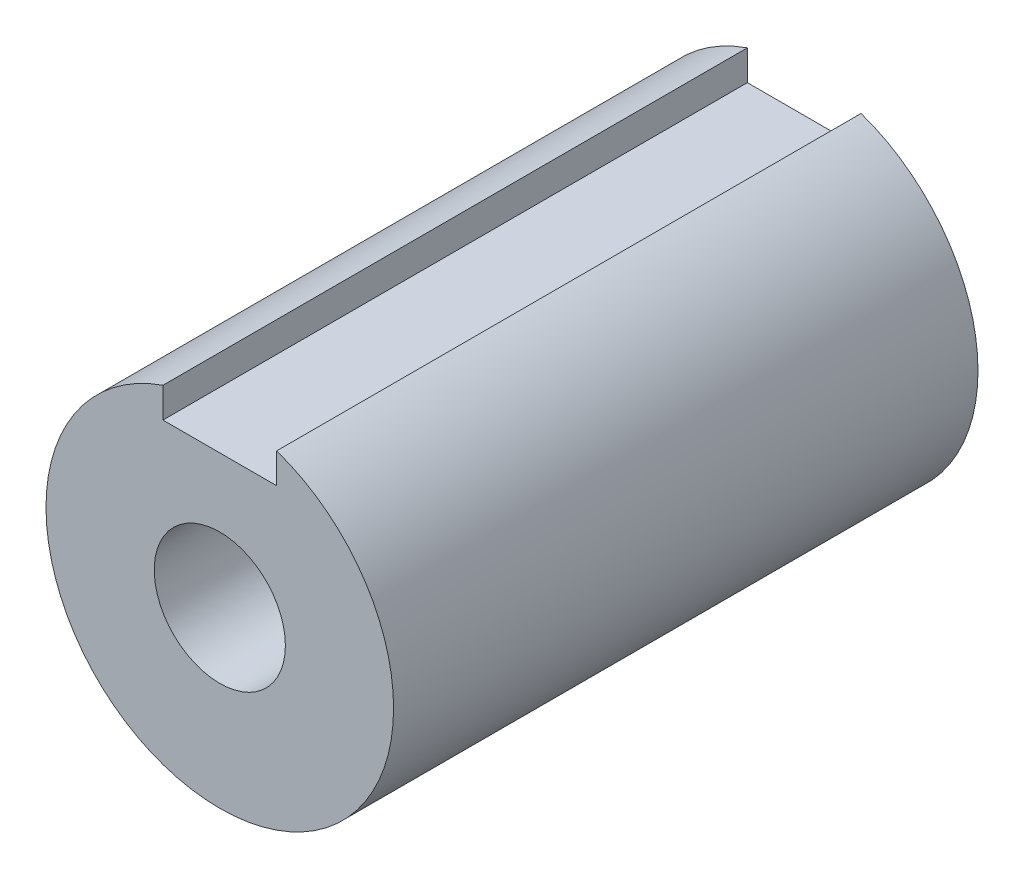
ISO-10303-21;
HEADER;
FILE_DESCRIPTION(('STEP AP214'),'2;1');
FILE_NAME('part.step','',(''),(''),'','','');
FILE_SCHEMA(('AUTOMOTIVE_DESIGN { 1 0 10303 214 1 1 1 1 }'));
ENDSEC;
DATA;
#1=APPLICATION_CONTEXT('core data for automotive mechanical design processes');
#2=APPLICATION_PROTOCOL_DEFINITION('international standard','automotive_design',2000,#1);
#3=PRODUCT_CONTEXT('',#1,'mechanical');
#4=PRODUCT('Part','Part','',(#3));
#5=PRODUCT_RELATED_PRODUCT_CATEGORY('part','',(#4));
#6=PRODUCT_DEFINITION_FORMATION('','',#4);
#7=PRODUCT_DEFINITION_CONTEXT('part definition',#1,'design');
#8=PRODUCT_DEFINITION('design','',#6,#7);
#9=PRODUCT_DEFINITION_SHAPE('','',#8);
#10=(LENGTH_UNIT() NAMED_UNIT(*) SI_UNIT(.MILLI.,.METRE.));
#11=(NAMED_UNIT(*) PLANE_ANGLE_UNIT() SI_UNIT($,.RADIAN.));
#12=(NAMED_UNIT(*) SI_UNIT($,.STERADIAN.) SOLID_ANGLE_UNIT());
#13=UNCERTAINTY_MEASURE_WITH_UNIT(LENGTH_MEASURE(1.E-05),#10,'distance_accuracy_value','');
#14=(GEOMETRIC_REPRESENTATION_CONTEXT(3) GLOBAL_UNCERTAINTY_ASSIGNED_CONTEXT((#13)) GLOBAL_UNIT_ASSIGNED_CONTEXT((#10,
#11,#12)) REPRESENTATION_CONTEXT('',''));
#15=CARTESIAN_POINT('',(0.,0.,0.));
#16=DIRECTION('',(0.,0.,1.));
#17=DIRECTION('',(1.,0.,0.));
#18=AXIS2_PLACEMENT_3D('',#15,#16,#17);
#19=CARTESIAN_POINT('',(0.,0.,9.77));
#20=DIRECTION('',(0.,0.,1.));
#21=DIRECTION('',(1.,0.,0.));
#22=AXIS2_PLACEMENT_3D('',#19,#20,#21);
#23=PLANE('',#22);
#24=DIRECTION('',(0.99996932426467,-0.00783265789241257,0.));
#25=VECTOR('',#24,1.);
#26=CARTESIAN_POINT('',(6.49805597382803,5.47953178300827,9.77));
#27=LINE('',#26,#25);
#28=CARTESIAN_POINT('',(-6.41142269290476,5.58065041486258,9.77));
#29=VERTEX_POINT('',#28);
#30=CARTESIAN_POINT('',(6.49805597382803,5.47953178300827,9.77));
#31=VERTEX_POINT('',#30);
#32=EDGE_CURVE('E128',#29,#31,#27,.T.);
#33=ORIENTED_EDGE('',*,*,#32,.F.);
#34=CARTESIAN_POINT('',(0.,0.,9.77));
#35=DIRECTION('',(0.,0.,1.));
#36=DIRECTION('',(1.,0.,0.));
#37=AXIS2_PLACEMENT_3D('',#34,#35,#36);
#38=CIRCLE('',#37,8.5);
#39=EDGE_CURVE('E136',#31,#29,#38,.T.);
#40=ORIENTED_EDGE('',*,*,#39,.F.);
#41=EDGE_LOOP('',(#33,#40));
#42=FACE_BOUND('',#41,.T.);
#43=ADVANCED_FACE('F33',(#42),#23,.F.);
#44=CARTESIAN_POINT('',(0.,0.,40.1));
#45=DIRECTION('',(0.,0.,-1.));
#46=DIRECTION('',(-1.,0.,0.));
#47=AXIS2_PLACEMENT_3D('',#44,#45,#46);
#48=CYLINDRICAL_SURFACE('',#47,11.925);
#49=CARTESIAN_POINT('',(0.,0.,40.1));
#50=DIRECTION('',(0.,0.,1.));
#51=DIRECTION('',(1.,0.,0.));
#52=AXIS2_PLACEMENT_3D('',#49,#50,#51);
#53=CIRCLE('',#52,11.925);
#54=CARTESIAN_POINT('',(-3.9,11.2692335586765,40.1));
#55=VERTEX_POINT('',#54);
#56=CARTESIAN_POINT('',(3.9,11.2692335586765,40.1));
#57=VERTEX_POINT('',#56);
#58=EDGE_CURVE('E11',#55,#57,#53,.T.);
#59=ORIENTED_EDGE('',*,*,#58,.F.);
#60=DIRECTION('',(0.,0.,1.));
#61=VECTOR('',#60,1.);
#62=CARTESIAN_POINT('',(-3.9,11.2692335586765,0.));
#63=LINE('',#62,#61);
#64=CARTESIAN_POINT('',(-3.9,11.2692335586765,0.));
#65=VERTEX_POINT('',#64);
#66=EDGE_CURVE('E119',#65,#55,#63,.T.);
#67=ORIENTED_EDGE('',*,*,#66,.F.);
#68=CARTESIAN_POINT('',(0.,0.,0.));
#69=DIRECTION('',(0.,0.,1.));
#70=DIRECTION('',(1.,0.,0.));
#71=AXIS2_PLACEMENT_3D('',#68,#69,#70);
#72=CIRCLE('',#71,11.925);
#73=CARTESIAN_POINT('',(3.9,11.2692335586765,0.));
#74=VERTEX_POINT('',#73);
#75=EDGE_CURVE('E42',#65,#74,#72,.T.);
#76=ORIENTED_EDGE('',*,*,#75,.T.);
#77=DIRECTION('',(0.,0.,1.));
#78=VECTOR('',#77,1.);
#79=CARTESIAN_POINT('',(3.9,11.2692335586765,0.));
#80=LINE('',#79,#78);
#81=EDGE_CURVE('E50',#74,#57,#80,.T.);
#82=ORIENTED_EDGE('',*,*,#81,.T.);
#83=EDGE_LOOP('',(#59,#67,#76,#82));
#84=FACE_BOUND('',#83,.T.);
#85=ADVANCED_FACE('F35',(#84),#48,.T.);
#86=CARTESIAN_POINT('',(0.,0.,40.1));
#87=DIRECTION('',(0.,0.,1.));
#88=DIRECTION('',(1.,0.,0.));
#89=AXIS2_PLACEMENT_3D('',#86,#87,#88);
#90=PLANE('',#89);
#91=DIRECTION('',(0.,-1.,0.));
#92=VECTOR('',#91,1.);
#93=CARTESIAN_POINT('',(-3.9,11.2692335586765,40.1));
#94=LINE('',#93,#92);
#95=CARTESIAN_POINT('',(-3.9,9.19959916758711,40.1));
#96=VERTEX_POINT('',#95);
#97=EDGE_CURVE('E107',#55,#96,#94,.T.);
#98=ORIENTED_EDGE('',*,*,#97,.F.);
#99=ORIENTED_EDGE('',*,*,#58,.T.);
#100=DIRECTION('',(0.,1.,0.));
#101=VECTOR('',#100,1.);
#102=CARTESIAN_POINT('',(3.9,9.19959916758711,40.1));
#103=LINE('',#102,#101);
#104=CARTESIAN_POINT('',(3.9,9.19959916758711,40.1));
#105=VERTEX_POINT('',#104);
#106=EDGE_CURVE('E110',#105,#57,#103,.T.);
#107=ORIENTED_EDGE('',*,*,#106,.F.);
#108=DIRECTION('',(1.,0.,0.));
#109=VECTOR('',#108,1.);
#110=CARTESIAN_POINT('',(-3.9,9.19959916758711,40.1));
#111=LINE('',#110,#109);
#112=EDGE_CURVE('E96',#96,#105,#111,.T.);
#113=ORIENTED_EDGE('',*,*,#112,.F.);
#114=EDGE_LOOP('',(#98,#99,#107,#113));
#115=FACE_BOUND('',#114,.T.);
#116=CARTESIAN_POINT('',(0.,0.,40.1));
#117=DIRECTION('',(0.,0.,1.));
#118=DIRECTION('',(1.,0.,0.));
#119=AXIS2_PLACEMENT_3D('',#116,#117,#118);
#120=CIRCLE('',#119,4.5);
#121=CARTESIAN_POINT('',(4.5,0.,40.1));
#122=VERTEX_POINT('',#121);
#123=EDGE_CURVE('E118',#122,#122,#120,.T.);
#124=ORIENTED_EDGE('',*,*,#123,.F.);
#125=EDGE_LOOP('',(#124));
#126=FACE_BOUND('',#125,.T.);
#127=ADVANCED_FACE('F147',(#115,#126),#90,.T.);
#128=CARTESIAN_POINT('',(0.,0.,0.));
#129=DIRECTION('',(0.,0.,1.));
#130=DIRECTION('',(1.,0.,0.));
#131=AXIS2_PLACEMENT_3D('',#128,#129,#130);
#132=PLANE('',#131);
#133=CARTESIAN_POINT('',(0.,0.,0.));
#134=DIRECTION('',(0.,0.,1.));
#135=DIRECTION('',(1.,0.,0.));
#136=AXIS2_PLACEMENT_3D('',#133,#134,#135);
#137=CIRCLE('',#136,8.5);
#138=CARTESIAN_POINT('',(8.5,0.,0.));
#139=VERTEX_POINT('',#138);
#140=EDGE_CURVE('E134',#139,#139,#137,.T.);
#141=ORIENTED_EDGE('',*,*,#140,.T.);
#142=EDGE_LOOP('',(#141));
#143=FACE_BOUND('',#142,.T.);
#144=ORIENTED_EDGE('',*,*,#75,.F.);
#145=DIRECTION('',(0.,-1.,0.));
#146=VECTOR('',#145,1.);
#147=CARTESIAN_POINT('',(-3.9,11.2692335586765,0.));
#148=LINE('',#147,#146);
#149=CARTESIAN_POINT('',(-3.9,9.19959916758711,0.));
#150=VERTEX_POINT('',#149);
#151=EDGE_CURVE('E98',#65,#150,#148,.T.);
#152=ORIENTED_EDGE('',*,*,#151,.T.);
#153=DIRECTION('',(1.,0.,0.));
#154=VECTOR('',#153,1.);
#155=CARTESIAN_POINT('',(-3.9,9.19959916758711,0.));
#156=LINE('',#155,#154);
#157=CARTESIAN_POINT('',(3.9,9.19959916758711,0.));
#158=VERTEX_POINT('',#157);
#159=EDGE_CURVE('E93',#150,#158,#156,.T.);
#160=ORIENTED_EDGE('',*,*,#159,.T.);
#161=DIRECTION('',(0.,1.,0.));
#162=VECTOR('',#161,1.);
#163=CARTESIAN_POINT('',(3.9,9.19959916758711,0.));
#164=LINE('',#163,#162);
#165=EDGE_CURVE('E100',#158,#74,#164,.T.);
#166=ORIENTED_EDGE('',*,*,#165,.T.);
#167=EDGE_LOOP('',(#144,#152,#160,#166));
#168=FACE_BOUND('',#167,.T.);
#169=ADVANCED_FACE('F106',(#143,#168),#132,.F.);
#170=CARTESIAN_POINT('',(0.,0.,9.77));
#171=DIRECTION('',(0.,0.,-1.));
#172=DIRECTION('',(-1.,0.,0.));
#173=AXIS2_PLACEMENT_3D('',#170,#171,#172);
#174=CYLINDRICAL_SURFACE('',#173,8.5);
#175=ORIENTED_EDGE('',*,*,#39,.T.);
#176=DIRECTION('',(0.,0.,-1.));
#177=VECTOR('',#176,1.);
#178=CARTESIAN_POINT('',(-6.41142269290476,5.58065041486258,25.27));
#179=LINE('',#178,#177);
#180=CARTESIAN_POINT('',(-6.41142269290476,5.58065041486258,25.27));
#181=VERTEX_POINT('',#180);
#182=EDGE_CURVE('E58',#181,#29,#179,.T.);
#183=ORIENTED_EDGE('',*,*,#182,.F.);
#184=CARTESIAN_POINT('',(0.,0.,25.27));
#185=DIRECTION('',(0.,0.,-1.));
#186=DIRECTION('',(-1.,0.,0.));
#187=AXIS2_PLACEMENT_3D('',#184,#185,#186);
#188=CIRCLE('',#187,8.5);
#189=CARTESIAN_POINT('',(6.49805597382803,5.47953178300827,25.27));
#190=VERTEX_POINT('',#189);
#191=EDGE_CURVE('E124',#190,#181,#188,.T.);
#192=ORIENTED_EDGE('',*,*,#191,.F.);
#193=DIRECTION('',(0.,0.,-1.));
#194=VECTOR('',#193,1.);
#195=CARTESIAN_POINT('',(6.49805597382803,5.47953178300827,25.27));
#196=LINE('',#195,#194);
#197=EDGE_CURVE('E132',#190,#31,#196,.T.);
#198=ORIENTED_EDGE('',*,*,#197,.T.);
#199=EDGE_LOOP('',(#175,#183,#192,#198));
#200=FACE_BOUND('',#199,.T.);
#201=ORIENTED_EDGE('',*,*,#140,.F.);
#202=EDGE_LOOP('',(#201));
#203=FACE_BOUND('',#202,.T.);
#204=ADVANCED_FACE('F177',(#200,#203),#174,.F.);
#205=CARTESIAN_POINT('',(6.49805597382803,5.47953178300827,25.27));
#206=DIRECTION('',(0.00783265789241257,0.99996932426467,0.));
#207=DIRECTION('',(-0.99996932426467,0.00783265789241257,0.));
#208=AXIS2_PLACEMENT_3D('',#205,#206,#207);
#209=PLANE('',#208);
#210=ORIENTED_EDGE('',*,*,#32,.T.);
#211=ORIENTED_EDGE('',*,*,#197,.F.);
#212=DIRECTION('',(0.99996932426467,-0.00783265789241257,0.));
#213=VECTOR('',#212,1.);
#214=CARTESIAN_POINT('',(6.49805597382803,5.47953178300827,25.27));
#215=LINE('',#214,#213);
#216=EDGE_CURVE('E127',#181,#190,#215,.T.);
#217=ORIENTED_EDGE('',*,*,#216,.F.);
#218=ORIENTED_EDGE('',*,*,#182,.T.);
#219=EDGE_LOOP('',(#210,#211,#217,#218));
#220=FACE_BOUND('',#219,.T.);
#221=ADVANCED_FACE('F164',(#220),#209,.F.);
#222=CARTESIAN_POINT('',(0.,0.,25.27));
#223=DIRECTION('',(0.,0.,-1.));
#224=DIRECTION('',(-1.,0.,0.));
#225=AXIS2_PLACEMENT_3D('',#222,#223,#224);
#226=PLANE('',#225);
#227=CARTESIAN_POINT('',(0.,0.,25.27));
#228=DIRECTION('',(0.,0.,-1.));
#229=DIRECTION('',(-1.,0.,0.));
#230=AXIS2_PLACEMENT_3D('',#227,#228,#229);
#231=CIRCLE('',#230,4.5);
#232=CARTESIAN_POINT('',(-4.5,0.,25.27));
#233=VERTEX_POINT('',#232);
#234=EDGE_CURVE('E37',#233,#233,#231,.T.);
#235=ORIENTED_EDGE('',*,*,#234,.F.);
#236=EDGE_LOOP('',(#235));
#237=FACE_BOUND('',#236,.T.);
#238=ORIENTED_EDGE('',*,*,#191,.T.);
#239=ORIENTED_EDGE('',*,*,#216,.T.);
#240=EDGE_LOOP('',(#238,#239));
#241=FACE_BOUND('',#240,.T.);
#242=ADVANCED_FACE('F155',(#237,#241),#226,.T.);
#243=CARTESIAN_POINT('',(0.,0.,0.));
#244=DIRECTION('',(0.,0.,1.));
#245=DIRECTION('',(1.,0.,0.));
#246=AXIS2_PLACEMENT_3D('',#243,#244,#245);
#247=CYLINDRICAL_SURFACE('',#246,4.5);
#248=ORIENTED_EDGE('',*,*,#234,.T.);
#249=EDGE_LOOP('',(#248));
#250=FACE_BOUND('',#249,.T.);
#251=ORIENTED_EDGE('',*,*,#123,.T.);
#252=EDGE_LOOP('',(#251));
#253=FACE_BOUND('',#252,.T.);
#254=ADVANCED_FACE('F153',(#250,#253),#247,.F.);
#255=CARTESIAN_POINT('',(-3.9,9.19959916758711,0.));
#256=DIRECTION('',(0.,-1.,0.));
#257=DIRECTION('',(0.,0.,-1.));
#258=AXIS2_PLACEMENT_3D('',#255,#256,#257);
#259=PLANE('',#258);
#260=ORIENTED_EDGE('',*,*,#112,.T.);
#261=DIRECTION('',(0.,0.,1.));
#262=VECTOR('',#261,1.);
#263=CARTESIAN_POINT('',(3.9,9.19959916758711,0.));
#264=LINE('',#263,#262);
#265=EDGE_CURVE('E90',#158,#105,#264,.T.);
#266=ORIENTED_EDGE('',*,*,#265,.F.);
#267=ORIENTED_EDGE('',*,*,#159,.F.);
#268=DIRECTION('',(0.,0.,1.));
#269=VECTOR('',#268,1.);
#270=CARTESIAN_POINT('',(-3.9,9.19959916758711,0.));
#271=LINE('',#270,#269);
#272=EDGE_CURVE('E116',#150,#96,#271,.T.);
#273=ORIENTED_EDGE('',*,*,#272,.T.);
#274=EDGE_LOOP('',(#260,#266,#267,#273));
#275=FACE_BOUND('',#274,.T.);
#276=ADVANCED_FACE('F91',(#275),#259,.F.);
#277=CARTESIAN_POINT('',(-3.9,11.2692335586765,0.));
#278=DIRECTION('',(-1.,0.,0.));
#279=DIRECTION('',(0.,-1.,0.));
#280=AXIS2_PLACEMENT_3D('',#277,#278,#279);
#281=PLANE('',#280);
#282=ORIENTED_EDGE('',*,*,#97,.T.);
#283=ORIENTED_EDGE('',*,*,#272,.F.);
#284=ORIENTED_EDGE('',*,*,#151,.F.);
#285=ORIENTED_EDGE('',*,*,#66,.T.);
#286=EDGE_LOOP('',(#282,#283,#284,#285));
#287=FACE_BOUND('',#286,.T.);
#288=ADVANCED_FACE('F145',(#287),#281,.F.);
#289=CARTESIAN_POINT('',(3.9,9.19959916758711,0.));
#290=DIRECTION('',(1.,0.,0.));
#291=DIRECTION('',(0.,0.,-1.));
#292=AXIS2_PLACEMENT_3D('',#289,#290,#291);
#293=PLANE('',#292);
#294=ORIENTED_EDGE('',*,*,#106,.T.);
#295=ORIENTED_EDGE('',*,*,#81,.F.);
#296=ORIENTED_EDGE('',*,*,#165,.F.);
#297=ORIENTED_EDGE('',*,*,#265,.T.);
#298=EDGE_LOOP('',(#294,#295,#296,#297));
#299=FACE_BOUND('',#298,.T.);
#300=ADVANCED_FACE('F101',(#299),#293,.F.);
#301=CLOSED_SHELL('',(#43,#85,#127,#169,#204,#221,#242,#254,#276,#288,#300));
#302=MANIFOLD_SOLID_BREP('B2',#301);
#303=ADVANCED_BREP_SHAPE_REPRESENTATION('',(#18,#302),#14);
#304=SHAPE_DEFINITION_REPRESENTATION(#9,#303);
ENDSEC;
END-ISO-10303-21;
